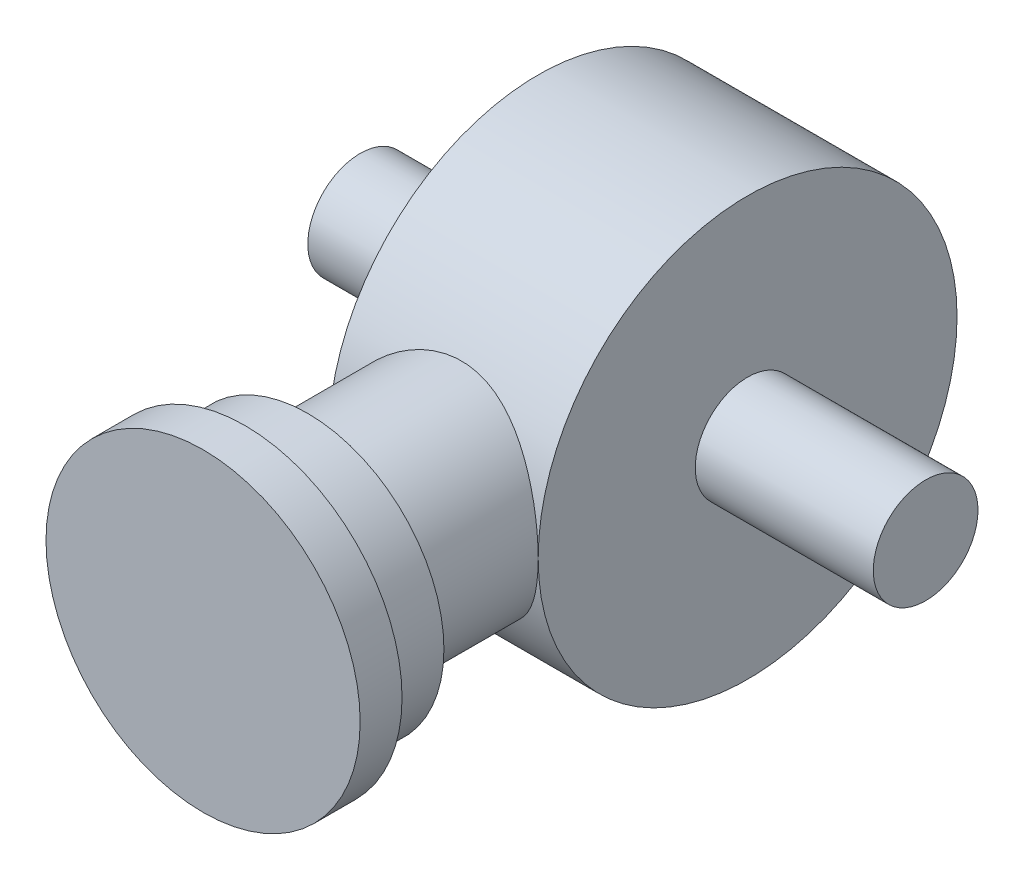
ISO-10303-21;
HEADER;
FILE_DESCRIPTION(('STEP AP214'),'2;1');
FILE_NAME('part.step','',(''),(''),'','','');
FILE_SCHEMA(('AUTOMOTIVE_DESIGN { 1 0 10303 214 1 1 1 1 }'));
ENDSEC;
DATA;
#1=APPLICATION_CONTEXT('core data for automotive mechanical design processes');
#2=APPLICATION_PROTOCOL_DEFINITION('international standard','automotive_design',2000,#1);
#3=PRODUCT_CONTEXT('',#1,'mechanical');
#4=PRODUCT('Part','Part','',(#3));
#5=PRODUCT_RELATED_PRODUCT_CATEGORY('part','',(#4));
#6=PRODUCT_DEFINITION_FORMATION('','',#4);
#7=PRODUCT_DEFINITION_CONTEXT('part definition',#1,'design');
#8=PRODUCT_DEFINITION('design','',#6,#7);
#9=PRODUCT_DEFINITION_SHAPE('','',#8);
#10=(LENGTH_UNIT() NAMED_UNIT(*) SI_UNIT(.MILLI.,.METRE.));
#11=(NAMED_UNIT(*) PLANE_ANGLE_UNIT() SI_UNIT($,.RADIAN.));
#12=(NAMED_UNIT(*) SI_UNIT($,.STERADIAN.) SOLID_ANGLE_UNIT());
#13=UNCERTAINTY_MEASURE_WITH_UNIT(LENGTH_MEASURE(1.E-05),#10,'distance_accuracy_value','');
#14=(GEOMETRIC_REPRESENTATION_CONTEXT(3) GLOBAL_UNCERTAINTY_ASSIGNED_CONTEXT((#13)) GLOBAL_UNIT_ASSIGNED_CONTEXT((#10,
#11,#12)) REPRESENTATION_CONTEXT('',''));
#15=CARTESIAN_POINT('',(0.,0.,0.));
#16=DIRECTION('',(0.,0.,1.));
#17=DIRECTION('',(1.,0.,0.));
#18=AXIS2_PLACEMENT_3D('',#15,#16,#17);
#19=CARTESIAN_POINT('',(12.7,0.,0.));
#20=DIRECTION('',(1.,0.,0.));
#21=DIRECTION('',(0.,0.,-1.));
#22=AXIS2_PLACEMENT_3D('',#19,#20,#21);
#23=PLANE('',#22);
#24=CARTESIAN_POINT('',(12.7,0.,0.));
#25=DIRECTION('',(1.,0.,0.));
#26=DIRECTION('',(0.,0.,-1.));
#27=AXIS2_PLACEMENT_3D('',#24,#25,#26);
#28=CIRCLE('',#27,25.4);
#29=CARTESIAN_POINT('',(12.7,0.,25.4));
#30=VERTEX_POINT('',#29);
#31=EDGE_CURVE('E43',#30,#30,#28,.T.);
#32=ORIENTED_EDGE('',*,*,#31,.T.);
#33=EDGE_LOOP('',(#32));
#34=FACE_BOUND('',#33,.T.);
#35=CARTESIAN_POINT('',(12.7,0.,0.));
#36=DIRECTION('',(1.,0.,0.));
#37=DIRECTION('',(0.,0.,-1.));
#38=AXIS2_PLACEMENT_3D('',#35,#36,#37);
#39=CIRCLE('',#38,6.35);
#40=CARTESIAN_POINT('',(12.7,0.,-6.35));
#41=VERTEX_POINT('',#40);
#42=EDGE_CURVE('E138',#41,#41,#39,.F.);
#43=ORIENTED_EDGE('',*,*,#42,.T.);
#44=EDGE_LOOP('',(#43));
#45=FACE_BOUND('',#44,.T.);
#46=ADVANCED_FACE('F35',(#34,#45),#23,.T.);
#47=CARTESIAN_POINT('',(-12.7,0.,0.));
#48=DIRECTION('',(1.,0.,0.));
#49=DIRECTION('',(0.,0.,-1.));
#50=AXIS2_PLACEMENT_3D('',#47,#48,#49);
#51=PLANE('',#50);
#52=CARTESIAN_POINT('',(-12.7,0.,0.));
#53=DIRECTION('',(1.,0.,0.));
#54=DIRECTION('',(0.,0.,-1.));
#55=AXIS2_PLACEMENT_3D('',#52,#53,#54);
#56=CIRCLE('',#55,25.4);
#57=CARTESIAN_POINT('',(-12.7,0.,25.4));
#58=VERTEX_POINT('',#57);
#59=EDGE_CURVE('E60',#58,#58,#56,.T.);
#60=ORIENTED_EDGE('',*,*,#59,.F.);
#61=EDGE_LOOP('',(#60));
#62=FACE_BOUND('',#61,.T.);
#63=CARTESIAN_POINT('',(-12.7,0.,0.));
#64=DIRECTION('',(1.,0.,0.));
#65=DIRECTION('',(0.,0.,-1.));
#66=AXIS2_PLACEMENT_3D('',#63,#64,#65);
#67=CIRCLE('',#66,6.35);
#68=CARTESIAN_POINT('',(-12.7,0.,-6.35));
#69=VERTEX_POINT('',#68);
#70=EDGE_CURVE('E11',#69,#69,#67,.F.);
#71=ORIENTED_EDGE('',*,*,#70,.F.);
#72=EDGE_LOOP('',(#71));
#73=FACE_BOUND('',#72,.T.);
#74=ADVANCED_FACE('F77',(#62,#73),#51,.F.);
#75=CARTESIAN_POINT('',(12.7,0.,0.));
#76=DIRECTION('',(-1.,0.,0.));
#77=DIRECTION('',(0.,0.,1.));
#78=AXIS2_PLACEMENT_3D('',#75,#76,#77);
#79=CYLINDRICAL_SURFACE('',#78,25.4);
#80=ORIENTED_EDGE('',*,*,#31,.F.);
#81=CARTESIAN_POINT('',(-12.7,0.,25.4));
#82=CARTESIAN_POINT('',(-12.7000075320675,-0.334227902540558,25.4000065559516));
#83=CARTESIAN_POINT('',(-12.6867979012213,-0.668377176531978,25.3933919823737));
#84=CARTESIAN_POINT('',(-12.6341366418875,-1.33418963602366,25.3671214717048));
#85=CARTESIAN_POINT('',(-12.5946796303352,-1.66585229743219,25.3474628594192));
#86=CARTESIAN_POINT('',(-12.4899419134687,-2.32435599102743,25.2955844242962));
#87=CARTESIAN_POINT('',(-12.424638541787,-2.65119252920193,25.2633535764008));
#88=CARTESIAN_POINT('',(-12.2689651877478,-3.29741527842774,25.1871574730545));
#89=CARTESIAN_POINT('',(-12.1785962430799,-3.61680179730913,25.1431927033792));
#90=CARTESIAN_POINT('',(-11.974116779298,-4.2449063490143,25.0447893859015));
#91=CARTESIAN_POINT('',(-11.8600926296096,-4.55365855597044,24.9903889934153));
#92=CARTESIAN_POINT('',(-11.6091906119499,-5.15987551395868,24.8722950084793));
#93=CARTESIAN_POINT('',(-11.4723125768133,-5.45734018240831,24.8086013480541));
#94=CARTESIAN_POINT('',(-11.176878389856,-6.03936145574322,24.6733736675621));
#95=CARTESIAN_POINT('',(-11.018325792984,-6.32392016722454,24.6018409336002));
#96=CARTESIAN_POINT('',(-10.6806250260259,-6.87894063563299,24.4524602707319));
#97=CARTESIAN_POINT('',(-10.5014687345593,-7.14939677226153,24.3746098551618));
#98=CARTESIAN_POINT('',(-10.1123653859141,-7.69075896614907,24.2094415482836));
#99=CARTESIAN_POINT('',(-9.90121395419657,-7.96071182540918,24.1218358475485));
#100=CARTESIAN_POINT('',(-9.45837742405131,-8.48210489403275,23.9434715823924));
#101=CARTESIAN_POINT('',(-9.22669115251155,-8.73354404424297,23.8527128380249));
#102=CARTESIAN_POINT('',(-8.74387729502205,-9.21690636029106,23.6701377759067));
#103=CARTESIAN_POINT('',(-8.49273840730742,-9.44881801508121,23.5783208701441));
#104=CARTESIAN_POINT('',(-7.9722852736554,-9.89189022407132,23.3958955130604));
#105=CARTESIAN_POINT('',(-7.70296762760132,-10.1030468780581,23.3052872916258));
#106=CARTESIAN_POINT('',(-7.12572522534577,-10.5190426808317,23.1206721884566));
#107=CARTESIAN_POINT('',(-6.81642729901838,-10.722108382666,23.0269503792836));
#108=CARTESIAN_POINT('',(-6.17987527381863,-11.1011846654923,22.8466136912253));
#109=CARTESIAN_POINT('',(-5.85262886439004,-11.2772067114832,22.7599958079733));
#110=CARTESIAN_POINT('',(-5.18198539960591,-11.6006709887549,22.5968417352572));
#111=CARTESIAN_POINT('',(-4.83859320751063,-11.7481217583055,22.5203025360663));
#112=CARTESIAN_POINT('',(-4.13780625649295,-12.0128599695755,22.3802068967669));
#113=CARTESIAN_POINT('',(-3.78041305417769,-12.1301507535227,22.3166490182729));
#114=CARTESIAN_POINT('',(-3.07604833735258,-12.3269432039937,22.2085191620235));
#115=CARTESIAN_POINT('',(-2.72973094592115,-12.4082846993322,22.1630393639196));
#116=CARTESIAN_POINT('',(-2.02982189876392,-12.5417986015641,22.0877611180317));
#117=CARTESIAN_POINT('',(-1.6762305548821,-12.5939722562307,22.0579619994459));
#118=CARTESIAN_POINT('',(-0.96518375422673,-12.6683105095499,22.0153527095978));
#119=CARTESIAN_POINT('',(-0.607731812938301,-12.6905004140932,22.0025282121657));
#120=CARTESIAN_POINT('',(0.107952254182772,-12.7045821886231,21.9944009953394));
#121=CARTESIAN_POINT('',(0.466184302321151,-12.6964769492485,21.9990966042482));
#122=CARTESIAN_POINT('',(1.13723108890566,-12.6528993792404,22.0241829776112));
#123=CARTESIAN_POINT('',(1.45034682063444,-12.6208209661067,22.0426266371524));
#124=CARTESIAN_POINT('',(2.07231407933172,-12.5337185881529,22.0922704378058));
#125=CARTESIAN_POINT('',(2.38116600363987,-12.4786967765199,22.1234693818575));
#126=CARTESIAN_POINT('',(2.99267158297998,-12.3463282910739,22.1976105957889));
#127=CARTESIAN_POINT('',(3.29532367433411,-12.2689760577109,22.2405557899634));
#128=CARTESIAN_POINT('',(3.89259360942259,-12.092753050119,22.3368617539041));
#129=CARTESIAN_POINT('',(4.18721102450074,-11.9938811303156,22.3902230781448));
#130=CARTESIAN_POINT('',(4.77356282527102,-11.7729988331913,22.5071646450358));
#131=CARTESIAN_POINT('',(5.06507453849555,-11.6505079979382,22.5709519354986));
#132=CARTESIAN_POINT('',(5.63682334806746,-11.3848861086522,22.7060910151595));
#133=CARTESIAN_POINT('',(5.91705644485921,-11.2417478138017,22.7774454557324));
#134=CARTESIAN_POINT('',(6.46503869042597,-10.9358020974744,22.9259054053455));
#135=CARTESIAN_POINT('',(6.73278547462078,-10.7729909712739,23.0030119965627));
#136=CARTESIAN_POINT('',(7.25471311876847,-10.4286571509734,23.1611528599823));
#137=CARTESIAN_POINT('',(7.50889422741349,-10.2471348000751,23.24218706013));
#138=CARTESIAN_POINT('',(8.03412008592087,-9.84207297352222,23.4168358517742));
#139=CARTESIAN_POINT('',(8.3032140527838,-9.61612448151882,23.5107423630467));
#140=CARTESIAN_POINT('',(8.8217271356287,-9.14277711997622,23.6988288138651));
#141=CARTESIAN_POINT('',(9.07114536218596,-8.89537728180754,23.7930087655724));
#142=CARTESIAN_POINT('',(9.54914614270668,-8.38017609008464,23.9793185349373));
#143=CARTESIAN_POINT('',(9.77771591314374,-8.11236240176926,24.071447068919));
#144=CARTESIAN_POINT('',(10.2124993424938,-7.55771398717195,24.2513085020062));
#145=CARTESIAN_POINT('',(10.4187102255638,-7.27087690625479,24.3390408546028));
#146=CARTESIAN_POINT('',(10.8164945006183,-6.66563477362501,24.5118941448025));
#147=CARTESIAN_POINT('',(11.0069150602108,-6.3463784083698,24.5966955591839));
#148=CARTESIAN_POINT('',(11.3598081577092,-5.6906350303462,24.7566255804175));
#149=CARTESIAN_POINT('',(11.5222930334197,-5.35415570975233,24.8317584536776));
#150=CARTESIAN_POINT('',(11.8174897683826,-4.666549811546,24.9701035721987));
#151=CARTESIAN_POINT('',(11.9502423373637,-4.31544405203666,25.0333320978423));
#152=CARTESIAN_POINT('',(12.1845846050113,-3.60100265413862,25.1460448564883));
#153=CARTESIAN_POINT('',(12.2861862911563,-3.23767178009931,25.1955343758384));
#154=CARTESIAN_POINT('',(12.480103071579,-2.40159814107709,25.290588646216));
#155=CARTESIAN_POINT('',(12.5623989100097,-1.92594379089569,25.3314357023151));
#156=CARTESIAN_POINT('',(12.6723392204265,-0.966804298745561,25.386135301499));
#157=CARTESIAN_POINT('',(12.6999891080356,-0.483319937549359,25.3999905195763));
#158=CARTESIAN_POINT('',(12.7000075320675,0.334227902540558,25.4000065559516));
#159=CARTESIAN_POINT('',(12.6867979012213,0.668377176531978,25.3933919823737));
#160=CARTESIAN_POINT('',(12.6341366418875,1.33418963602366,25.3671214717048));
#161=CARTESIAN_POINT('',(12.5946796303352,1.66585229743219,25.3474628594192));
#162=CARTESIAN_POINT('',(12.4899419134687,2.32435599102743,25.2955844242962));
#163=CARTESIAN_POINT('',(12.424638541787,2.65119252920192,25.2633535764008));
#164=CARTESIAN_POINT('',(12.2689651877478,3.29741527842774,25.1871574730545));
#165=CARTESIAN_POINT('',(12.1785962430799,3.61680179730913,25.1431927033792));
#166=CARTESIAN_POINT('',(11.974116779298,4.2449063490143,25.0447893859015));
#167=CARTESIAN_POINT('',(11.8600926296096,4.55365855597044,24.9903889934153));
#168=CARTESIAN_POINT('',(11.6091906119498,5.15987551395868,24.8722950084793));
#169=CARTESIAN_POINT('',(11.4723125768133,5.45734018240831,24.8086013480541));
#170=CARTESIAN_POINT('',(11.176878389856,6.03936145574322,24.6733736675621));
#171=CARTESIAN_POINT('',(11.018325792984,6.32392016722454,24.6018409336002));
#172=CARTESIAN_POINT('',(10.6806250260259,6.87894063563299,24.4524602707319));
#173=CARTESIAN_POINT('',(10.5014687345593,7.14939677226153,24.3746098551618));
#174=CARTESIAN_POINT('',(10.1123653859141,7.69075896614907,24.2094415482836));
#175=CARTESIAN_POINT('',(9.90121395419657,7.96071182540918,24.1218358475485));
#176=CARTESIAN_POINT('',(9.45837742405131,8.48210489403275,23.9434715823923));
#177=CARTESIAN_POINT('',(9.22669115251155,8.73354404424297,23.8527128380249));
#178=CARTESIAN_POINT('',(8.74387729502205,9.21690636029106,23.6701377759067));
#179=CARTESIAN_POINT('',(8.49273840730742,9.44881801508121,23.5783208701441));
#180=CARTESIAN_POINT('',(7.9722852736554,9.89189022407132,23.3958955130604));
#181=CARTESIAN_POINT('',(7.70296762760132,10.1030468780581,23.3052872916258));
#182=CARTESIAN_POINT('',(7.12572522534577,10.5190426808317,23.1206721884566));
#183=CARTESIAN_POINT('',(6.81642729901838,10.722108382666,23.0269503792836));
#184=CARTESIAN_POINT('',(6.17987527381863,11.1011846654923,22.8466136912253));
#185=CARTESIAN_POINT('',(5.85262886439004,11.2772067114832,22.7599958079733));
#186=CARTESIAN_POINT('',(5.18198539960591,11.6006709887549,22.5968417352572));
#187=CARTESIAN_POINT('',(4.83859320751063,11.7481217583055,22.5203025360663));
#188=CARTESIAN_POINT('',(4.13780625649295,12.0128599695755,22.3802068967669));
#189=CARTESIAN_POINT('',(3.78041305417769,12.1301507535227,22.3166490182729));
#190=CARTESIAN_POINT('',(3.07604833735258,12.3269432039937,22.2085191620235));
#191=CARTESIAN_POINT('',(2.72973094592115,12.4082846993322,22.1630393639196));
#192=CARTESIAN_POINT('',(2.02982189876392,12.5417986015641,22.0877611180317));
#193=CARTESIAN_POINT('',(1.6762305548821,12.5939722562307,22.0579619994459));
#194=CARTESIAN_POINT('',(0.965183754226729,12.6683105095499,22.0153527095978));
#195=CARTESIAN_POINT('',(0.607731812938299,12.6905004140932,22.0025282121657));
#196=CARTESIAN_POINT('',(-0.107952254182773,12.7045821886231,21.9944009953394));
#197=CARTESIAN_POINT('',(-0.466184302321151,12.6964769492485,21.9990966042482));
#198=CARTESIAN_POINT('',(-1.13723108890566,12.6528993792404,22.0241829776112));
#199=CARTESIAN_POINT('',(-1.45034682063444,12.6208209661067,22.0426266371524));
#200=CARTESIAN_POINT('',(-2.07231407933172,12.5337185881529,22.0922704378058));
#201=CARTESIAN_POINT('',(-2.38116600363987,12.4786967765199,22.1234693818575));
#202=CARTESIAN_POINT('',(-2.99267158297997,12.3463282910739,22.1976105957889));
#203=CARTESIAN_POINT('',(-3.29532367433411,12.2689760577109,22.2405557899634));
#204=CARTESIAN_POINT('',(-3.89259360942259,12.092753050119,22.3368617539041));
#205=CARTESIAN_POINT('',(-4.18721102450074,11.9938811303156,22.3902230781448));
#206=CARTESIAN_POINT('',(-4.77356282527101,11.7729988331913,22.5071646450358));
#207=CARTESIAN_POINT('',(-5.06507453849555,11.6505079979382,22.5709519354986));
#208=CARTESIAN_POINT('',(-5.63682334806746,11.3848861086522,22.7060910151595));
#209=CARTESIAN_POINT('',(-5.91705644485921,11.2417478138017,22.7774454557324));
#210=CARTESIAN_POINT('',(-6.46503869042597,10.9358020974744,22.9259054053455));
#211=CARTESIAN_POINT('',(-6.73278547462077,10.7729909712739,23.0030119965627));
#212=CARTESIAN_POINT('',(-7.25471311876847,10.4286571509734,23.1611528599823));
#213=CARTESIAN_POINT('',(-7.50889422741349,10.2471348000751,23.24218706013));
#214=CARTESIAN_POINT('',(-8.03412008592087,9.84207297352222,23.4168358517742));
#215=CARTESIAN_POINT('',(-8.3032140527838,9.61612448151882,23.5107423630467));
#216=CARTESIAN_POINT('',(-8.8217271356287,9.14277711997623,23.6988288138651));
#217=CARTESIAN_POINT('',(-9.07114536218596,8.89537728180754,23.7930087655724));
#218=CARTESIAN_POINT('',(-9.54914614270667,8.38017609008464,23.9793185349373));
#219=CARTESIAN_POINT('',(-9.77771591314373,8.11236240176927,24.071447068919));
#220=CARTESIAN_POINT('',(-10.2124993424938,7.55771398717195,24.2513085020062));
#221=CARTESIAN_POINT('',(-10.4187102255638,7.27087690625479,24.3390408546028));
#222=CARTESIAN_POINT('',(-10.8164945006183,6.66563477362501,24.5118941448025));
#223=CARTESIAN_POINT('',(-11.0069150602108,6.34637840836979,24.5966955591839));
#224=CARTESIAN_POINT('',(-11.3598081577092,5.69063503034619,24.7566255804175));
#225=CARTESIAN_POINT('',(-11.5222930334197,5.35415570975232,24.8317584536776));
#226=CARTESIAN_POINT('',(-11.8174897683826,4.666549811546,24.9701035721987));
#227=CARTESIAN_POINT('',(-11.9502423373637,4.31544405203666,25.0333320978423));
#228=CARTESIAN_POINT('',(-12.1845846050113,3.60100265413861,25.1460448564883));
#229=CARTESIAN_POINT('',(-12.2861862911563,3.23767178009931,25.1955343758384));
#230=CARTESIAN_POINT('',(-12.480103071579,2.40159814107709,25.290588646216));
#231=CARTESIAN_POINT('',(-12.5623989100097,1.92594379089569,25.3314357023151));
#232=CARTESIAN_POINT('',(-12.6723392204265,0.966804298745556,25.386135301499));
#233=CARTESIAN_POINT('',(-12.6999891080356,0.483319937549357,25.3999905195763));
#234=CARTESIAN_POINT('',(-12.7,0.,25.4));
#235=B_SPLINE_CURVE_WITH_KNOTS('',3,(#81,#82,#83,#84,#85,#86,#87,#88,#89,#90,#91,#92,#93,#94,
#95,#96,#97,#98,#99,#100,#101,#102,#103,#104,#105,#106,#107,#108,#109,#110,#111,#112,#113,#114,
#115,#116,#117,#118,#119,#120,#121,#122,#123,#124,#125,#126,#127,#128,#129,#130,#131,#132,#133,
#134,#135,#136,#137,#138,#139,#140,#141,#142,#143,#144,#145,#146,#147,#148,#149,#150,#151,#152,
#153,#154,#155,#156,#157,#158,#159,#160,#161,#162,#163,#164,#165,#166,#167,#168,#169,#170,#171,
#172,#173,#174,#175,#176,#177,#178,#179,#180,#181,#182,#183,#184,#185,#186,#187,#188,#189,#190,
#191,#192,#193,#194,#195,#196,#197,#198,#199,#200,#201,#202,#203,#204,#205,#206,#207,#208,#209,
#210,#211,#212,#213,#214,#215,#216,#217,#218,#219,#220,#221,#222,#223,#224,#225,#226,#227,#228,
#229,#230,#231,#232,#233,#234),.UNSPECIFIED.,.T.,.F.,(4,2,2,2,2,2,2,2,2,2,2,2,2,2,2,2,2,2,2,2,2,
2,2,2,2,2,2,2,2,2,2,2,2,2,2,2,2,2,2,2,2,2,2,2,2,2,2,2,2,2,2,2,2,2,2,2,2,2,2,2,2,2,2,2,2,2,2,2,2,
2,2,2,2,2,2,2,4),(0.,1.00222375260369,2.00465311426946,3.00796352675839,4.01123240939895,
5.0109006883724,6.01057627976055,7.01008810584387,8.00999526972287,9.07010118408974,
10.1302676991514,11.1910548476781,12.2520409563423,13.3956759388577,14.5388247381891,
15.6816313890958,16.8243113433993,17.8986842268624,18.9730111461313,20.0464307800791,
21.1197479953307,22.0645179440158,23.0091992480778,23.9541159502457,24.8990829662208,
25.8658135403799,26.832883963357,27.8001367865491,28.7673718715284,29.857299251817,
30.9472758731248,32.0379163983348,33.1286921712796,34.2710336982866,35.4128694064703,
36.5531320134575,37.6929552724024,39.1423936058724,40.5916882872467,41.5939120398504,
42.5963414015161,43.5996518140051,44.6029206966456,45.6025889756191,46.6022645670072,
47.6017763930905,48.6016835569695,49.6617894713364,50.7219559863981,51.7827431349247,
52.843729243589,53.9873642261043,55.1305130254358,56.2733196763425,57.415999630646,
58.4903725141091,59.564699433378,60.6381190673258,61.7114362825774,62.6562062312625,
63.6008875353245,64.5458042374924,65.4907712534675,66.4575018276265,67.4245722506036,
68.3918250737958,69.3590601587751,70.4489875390637,71.5389641603715,72.6296046855815,
73.7203804585263,74.8627219855333,76.004557693717,77.1448203007042,78.2846435596491,
79.7340818931191,81.1833765744934),.UNSPECIFIED.);
#236=EDGE_CURVE('E49',#58,#30,#235,.T.);
#237=ORIENTED_EDGE('',*,*,#236,.F.);
#238=ORIENTED_EDGE('',*,*,#59,.T.);
#239=EDGE_CURVE('E51',#30,#58,#235,.T.);
#240=ORIENTED_EDGE('',*,*,#239,.F.);
#241=EDGE_LOOP('',(#80,#237,#238,#240));
#242=FACE_BOUND('',#241,.T.);
#243=ADVANCED_FACE('F37',(#242),#79,.T.);
#244=CARTESIAN_POINT('',(0.,0.,-25.401));
#245=DIRECTION('',(0.,0.,1.));
#246=DIRECTION('',(1.,0.,0.));
#247=AXIS2_PLACEMENT_3D('',#244,#245,#246);
#248=CYLINDRICAL_SURFACE('',#247,12.7);
#249=CARTESIAN_POINT('',(0.,0.,40.64));
#250=DIRECTION('',(0.,0.,1.));
#251=DIRECTION('',(1.,0.,0.));
#252=AXIS2_PLACEMENT_3D('',#249,#250,#251);
#253=CIRCLE('',#252,12.7);
#254=CARTESIAN_POINT('',(12.7,0.,40.64));
#255=VERTEX_POINT('',#254);
#256=EDGE_CURVE('E61',#255,#255,#253,.T.);
#257=ORIENTED_EDGE('',*,*,#256,.F.);
#258=EDGE_LOOP('',(#257));
#259=FACE_BOUND('',#258,.T.);
#260=ORIENTED_EDGE('',*,*,#236,.T.);
#261=ORIENTED_EDGE('',*,*,#239,.T.);
#262=EDGE_LOOP('',(#260,#261));
#263=FACE_BOUND('',#262,.T.);
#264=ADVANCED_FACE('F52',(#259,#263),#248,.T.);
#265=CARTESIAN_POINT('',(0.,0.,48.26));
#266=DIRECTION('',(0.,0.,-1.));
#267=DIRECTION('',(-1.,0.,0.));
#268=AXIS2_PLACEMENT_3D('',#265,#266,#267);
#269=CYLINDRICAL_SURFACE('',#268,16.51);
#270=CARTESIAN_POINT('',(0.,0.,48.26));
#271=DIRECTION('',(0.,0.,1.));
#272=DIRECTION('',(1.,0.,0.));
#273=AXIS2_PLACEMENT_3D('',#270,#271,#272);
#274=CIRCLE('',#273,16.51);
#275=CARTESIAN_POINT('',(16.51,0.,48.26));
#276=VERTEX_POINT('',#275);
#277=EDGE_CURVE('E57',#276,#276,#274,.T.);
#278=ORIENTED_EDGE('',*,*,#277,.F.);
#279=EDGE_LOOP('',(#278));
#280=FACE_BOUND('',#279,.T.);
#281=CARTESIAN_POINT('',(0.,0.,40.64));
#282=DIRECTION('',(0.,0.,1.));
#283=DIRECTION('',(1.,0.,0.));
#284=AXIS2_PLACEMENT_3D('',#281,#282,#283);
#285=CIRCLE('',#284,16.51);
#286=CARTESIAN_POINT('',(16.51,0.,40.64));
#287=VERTEX_POINT('',#286);
#288=EDGE_CURVE('E69',#287,#287,#285,.T.);
#289=ORIENTED_EDGE('',*,*,#288,.T.);
#290=EDGE_LOOP('',(#289));
#291=FACE_BOUND('',#290,.T.);
#292=ADVANCED_FACE('F118',(#280,#291),#269,.T.);
#293=CARTESIAN_POINT('',(0.,0.,40.64));
#294=DIRECTION('',(0.,0.,1.));
#295=DIRECTION('',(1.,0.,0.));
#296=AXIS2_PLACEMENT_3D('',#293,#294,#295);
#297=PLANE('',#296);
#298=ORIENTED_EDGE('',*,*,#256,.T.);
#299=EDGE_LOOP('',(#298));
#300=FACE_BOUND('',#299,.T.);
#301=ORIENTED_EDGE('',*,*,#288,.F.);
#302=EDGE_LOOP('',(#301));
#303=FACE_BOUND('',#302,.T.);
#304=ADVANCED_FACE('F112',(#300,#303),#297,.F.);
#305=CARTESIAN_POINT('',(0.,0.,48.26));
#306=DIRECTION('',(0.,0.,1.));
#307=DIRECTION('',(1.,0.,0.));
#308=AXIS2_PLACEMENT_3D('',#305,#306,#307);
#309=PLANE('',#308);
#310=CARTESIAN_POINT('',(0.,0.,48.26));
#311=DIRECTION('',(0.,0.,1.));
#312=DIRECTION('',(1.,0.,0.));
#313=AXIS2_PLACEMENT_3D('',#310,#311,#312);
#314=CIRCLE('',#313,19.05);
#315=CARTESIAN_POINT('',(19.05,0.,48.26));
#316=VERTEX_POINT('',#315);
#317=EDGE_CURVE('E134',#316,#316,#314,.T.);
#318=ORIENTED_EDGE('',*,*,#317,.F.);
#319=EDGE_LOOP('',(#318));
#320=FACE_BOUND('',#319,.T.);
#321=ORIENTED_EDGE('',*,*,#277,.T.);
#322=EDGE_LOOP('',(#321));
#323=FACE_BOUND('',#322,.T.);
#324=ADVANCED_FACE('F109',(#320,#323),#309,.F.);
#325=CARTESIAN_POINT('',(0.,0.,53.34));
#326=DIRECTION('',(0.,0.,-1.));
#327=DIRECTION('',(-1.,0.,0.));
#328=AXIS2_PLACEMENT_3D('',#325,#326,#327);
#329=CYLINDRICAL_SURFACE('',#328,19.05);
#330=CARTESIAN_POINT('',(0.,0.,53.34));
#331=DIRECTION('',(0.,0.,1.));
#332=DIRECTION('',(1.,0.,0.));
#333=AXIS2_PLACEMENT_3D('',#330,#331,#332);
#334=CIRCLE('',#333,19.05);
#335=CARTESIAN_POINT('',(19.05,0.,53.34));
#336=VERTEX_POINT('',#335);
#337=EDGE_CURVE('E132',#336,#336,#334,.T.);
#338=ORIENTED_EDGE('',*,*,#337,.F.);
#339=EDGE_LOOP('',(#338));
#340=FACE_BOUND('',#339,.T.);
#341=ORIENTED_EDGE('',*,*,#317,.T.);
#342=EDGE_LOOP('',(#341));
#343=FACE_BOUND('',#342,.T.);
#344=ADVANCED_FACE('F107',(#340,#343),#329,.T.);
#345=CARTESIAN_POINT('',(0.,0.,53.34));
#346=DIRECTION('',(0.,0.,1.));
#347=DIRECTION('',(1.,0.,0.));
#348=AXIS2_PLACEMENT_3D('',#345,#346,#347);
#349=PLANE('',#348);
#350=ORIENTED_EDGE('',*,*,#337,.T.);
#351=EDGE_LOOP('',(#350));
#352=FACE_BOUND('',#351,.T.);
#353=ADVANCED_FACE('F99',(#352),#349,.T.);
#354=CARTESIAN_POINT('',(-34.29,0.,0.));
#355=DIRECTION('',(1.,0.,0.));
#356=DIRECTION('',(0.,0.,-1.));
#357=AXIS2_PLACEMENT_3D('',#354,#355,#356);
#358=PLANE('',#357);
#359=CARTESIAN_POINT('',(-34.29,0.,0.));
#360=DIRECTION('',(1.,0.,0.));
#361=DIRECTION('',(0.,0.,-1.));
#362=AXIS2_PLACEMENT_3D('',#359,#360,#361);
#363=CIRCLE('',#362,6.35);
#364=CARTESIAN_POINT('',(-34.29,0.,-6.35));
#365=VERTEX_POINT('',#364);
#366=EDGE_CURVE('E144',#365,#365,#363,.T.);
#367=ORIENTED_EDGE('',*,*,#366,.F.);
#368=EDGE_LOOP('',(#367));
#369=FACE_BOUND('',#368,.T.);
#370=ADVANCED_FACE('F90',(#369),#358,.F.);
#371=CARTESIAN_POINT('',(34.29,0.,0.));
#372=DIRECTION('',(-1.,0.,0.));
#373=DIRECTION('',(0.,0.,1.));
#374=AXIS2_PLACEMENT_3D('',#371,#372,#373);
#375=CYLINDRICAL_SURFACE('',#374,6.35);
#376=ORIENTED_EDGE('',*,*,#366,.T.);
#377=EDGE_LOOP('',(#376));
#378=FACE_BOUND('',#377,.T.);
#379=ORIENTED_EDGE('',*,*,#70,.T.);
#380=EDGE_LOOP('',(#379));
#381=FACE_BOUND('',#380,.T.);
#382=ADVANCED_FACE('F87',(#378,#381),#375,.T.);
#383=ORIENTED_EDGE('',*,*,#42,.F.);
#384=EDGE_LOOP('',(#383));
#385=FACE_BOUND('',#384,.T.);
#386=CARTESIAN_POINT('',(34.29,0.,0.));
#387=DIRECTION('',(1.,0.,0.));
#388=DIRECTION('',(0.,0.,-1.));
#389=AXIS2_PLACEMENT_3D('',#386,#387,#388);
#390=CIRCLE('',#389,6.35);
#391=CARTESIAN_POINT('',(34.29,0.,-6.35));
#392=VERTEX_POINT('',#391);
#393=EDGE_CURVE('E143',#392,#392,#390,.T.);
#394=ORIENTED_EDGE('',*,*,#393,.F.);
#395=EDGE_LOOP('',(#394));
#396=FACE_BOUND('',#395,.T.);
#397=ADVANCED_FACE('F89',(#385,#396),#375,.T.);
#398=CARTESIAN_POINT('',(34.29,0.,0.));
#399=DIRECTION('',(1.,0.,0.));
#400=DIRECTION('',(0.,0.,-1.));
#401=AXIS2_PLACEMENT_3D('',#398,#399,#400);
#402=PLANE('',#401);
#403=ORIENTED_EDGE('',*,*,#393,.T.);
#404=EDGE_LOOP('',(#403));
#405=FACE_BOUND('',#404,.T.);
#406=ADVANCED_FACE('F97',(#405),#402,.T.);
#407=CLOSED_SHELL('',(#46,#74,#243,#264,#292,#304,#324,#344,#353,#370,#382,#397,#406));
#408=MANIFOLD_SOLID_BREP('B2',#407);
#409=ADVANCED_BREP_SHAPE_REPRESENTATION('',(#18,#408),#14);
#410=SHAPE_DEFINITION_REPRESENTATION(#9,#409);
ENDSEC;
END-ISO-10303-21;
